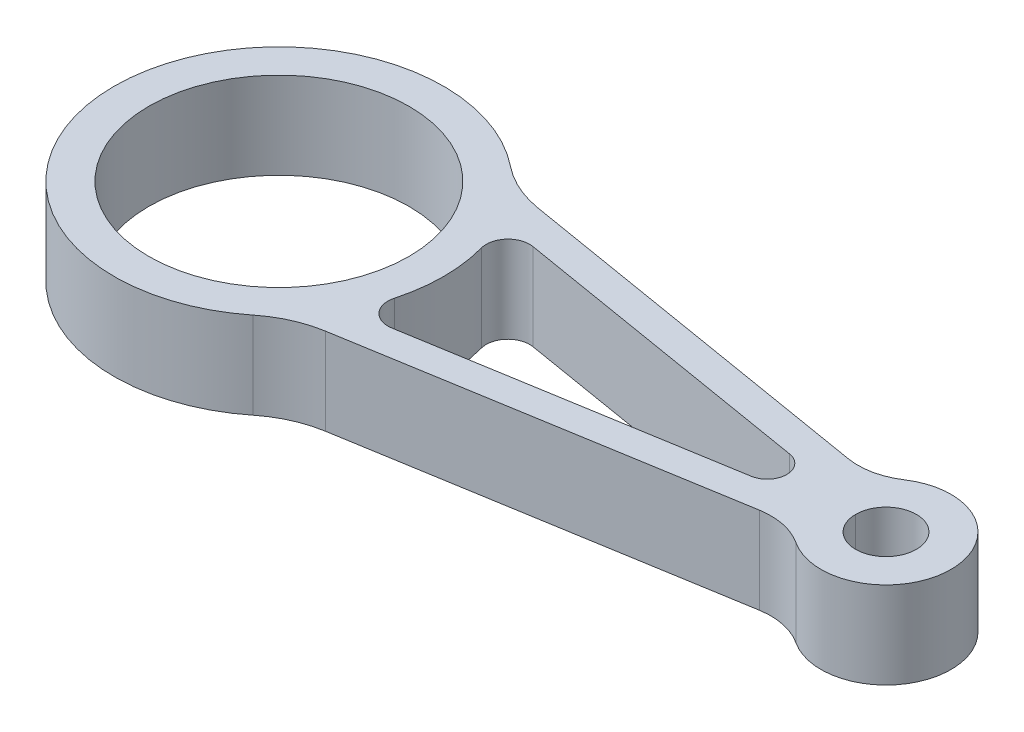
ISO-10303-21;
HEADER;
FILE_DESCRIPTION(('STEP AP214'),'2;1');
FILE_NAME('part.step','',(''),(''),'','','');
FILE_SCHEMA(('AUTOMOTIVE_DESIGN { 1 0 10303 214 1 1 1 1 }'));
ENDSEC;
DATA;
#1=APPLICATION_CONTEXT('core data for automotive mechanical design processes');
#2=APPLICATION_PROTOCOL_DEFINITION('international standard','automotive_design',2000,#1);
#3=PRODUCT_CONTEXT('',#1,'mechanical');
#4=PRODUCT('Part','Part','',(#3));
#5=PRODUCT_RELATED_PRODUCT_CATEGORY('part','',(#4));
#6=PRODUCT_DEFINITION_FORMATION('','',#4);
#7=PRODUCT_DEFINITION_CONTEXT('part definition',#1,'design');
#8=PRODUCT_DEFINITION('design','',#6,#7);
#9=PRODUCT_DEFINITION_SHAPE('','',#8);
#10=(LENGTH_UNIT() NAMED_UNIT(*) SI_UNIT(.MILLI.,.METRE.));
#11=(NAMED_UNIT(*) PLANE_ANGLE_UNIT() SI_UNIT($,.RADIAN.));
#12=(NAMED_UNIT(*) SI_UNIT($,.STERADIAN.) SOLID_ANGLE_UNIT());
#13=UNCERTAINTY_MEASURE_WITH_UNIT(LENGTH_MEASURE(1.E-05),#10,'distance_accuracy_value','');
#14=(GEOMETRIC_REPRESENTATION_CONTEXT(3) GLOBAL_UNCERTAINTY_ASSIGNED_CONTEXT((#13)) GLOBAL_UNIT_ASSIGNED_CONTEXT((#10,
#11,#12)) REPRESENTATION_CONTEXT('',''));
#15=CARTESIAN_POINT('',(0.,0.,0.));
#16=DIRECTION('',(0.,0.,1.));
#17=DIRECTION('',(1.,0.,0.));
#18=AXIS2_PLACEMENT_3D('',#15,#16,#17);
#19=CARTESIAN_POINT('',(140.,10.,0.));
#20=DIRECTION('',(0.,-1.,0.));
#21=DIRECTION('',(0.,0.,-1.));
#22=AXIS2_PLACEMENT_3D('',#19,#20,#21);
#23=CYLINDRICAL_SURFACE('',#22,7.00000000000001);
#24=CARTESIAN_POINT('',(140.,10.,0.));
#25=DIRECTION('',(0.,1.,0.));
#26=DIRECTION('',(0.,0.,1.));
#27=AXIS2_PLACEMENT_3D('',#24,#25,#26);
#28=CIRCLE('',#27,7.00000000000001);
#29=CARTESIAN_POINT('',(147.,10.,0.));
#30=VERTEX_POINT('',#29);
#31=CARTESIAN_POINT('',(133.,10.,0.));
#32=VERTEX_POINT('',#31);
#33=EDGE_CURVE('E232',#30,#32,#28,.T.);
#34=ORIENTED_EDGE('',*,*,#33,.T.);
#35=DIRECTION('',(0.,-1.,0.));
#36=VECTOR('',#35,1.);
#37=CARTESIAN_POINT('',(133.,10.,0.));
#38=LINE('',#37,#36);
#39=CARTESIAN_POINT('',(133.,-10.,0.));
#40=VERTEX_POINT('',#39);
#41=EDGE_CURVE('E11',#32,#40,#38,.T.);
#42=ORIENTED_EDGE('',*,*,#41,.T.);
#43=CARTESIAN_POINT('',(140.,-10.,0.));
#44=DIRECTION('',(0.,1.,0.));
#45=DIRECTION('',(0.,0.,1.));
#46=AXIS2_PLACEMENT_3D('',#43,#44,#45);
#47=CIRCLE('',#46,7.00000000000001);
#48=CARTESIAN_POINT('',(147.,-10.,0.));
#49=VERTEX_POINT('',#48);
#50=EDGE_CURVE('E237',#49,#40,#47,.T.);
#51=ORIENTED_EDGE('',*,*,#50,.F.);
#52=DIRECTION('',(0.,1.,0.));
#53=VECTOR('',#52,1.);
#54=CARTESIAN_POINT('',(147.,10.,0.));
#55=LINE('',#54,#53);
#56=EDGE_CURVE('E52',#49,#30,#55,.T.);
#57=ORIENTED_EDGE('',*,*,#56,.T.);
#58=EDGE_LOOP('',(#34,#42,#51,#57));
#59=FACE_BOUND('',#58,.T.);
#60=ADVANCED_FACE('F43',(#59),#23,.F.);
#61=CARTESIAN_POINT('',(0.,10.,0.));
#62=DIRECTION('',(0.,1.,0.));
#63=DIRECTION('',(0.,0.,1.));
#64=AXIS2_PLACEMENT_3D('',#61,#62,#63);
#65=PLANE('',#64);
#66=CARTESIAN_POINT('',(112.608695652174,10.,0.));
#67=DIRECTION('',(0.,-1.,0.));
#68=DIRECTION('',(0.,0.,1.));
#69=AXIS2_PLACEMENT_3D('',#66,#67,#68);
#70=CIRCLE('',#69,4.5);
#71=CARTESIAN_POINT('',(113.34798136646,10.,-4.4388575819295));
#72=VERTEX_POINT('',#71);
#73=CARTESIAN_POINT('',(113.34798136646,10.,4.43885758192951));
#74=VERTEX_POINT('',#73);
#75=EDGE_CURVE('E158',#72,#74,#70,.T.);
#76=ORIENTED_EDGE('',*,*,#75,.T.);
#77=DIRECTION('',(-0.986412795984335,0.,0.164285714285714));
#78=VECTOR('',#77,1.);
#79=CARTESIAN_POINT('',(42.2992225293056,10.,16.2719320738592));
#80=LINE('',#79,#78);
#81=CARTESIAN_POINT('',(42.2992225293056,10.,16.2719320738592));
#82=VERTEX_POINT('',#81);
#83=EDGE_CURVE('E171',#74,#82,#80,.T.);
#84=ORIENTED_EDGE('',*,*,#83,.T.);
#85=CARTESIAN_POINT('',(41.477793957877,10.,11.3398680939376));
#86=DIRECTION('',(0.,-1.,0.));
#87=DIRECTION('',(0.,0.,1.));
#88=AXIS2_PLACEMENT_3D('',#85,#86,#87);
#89=CIRCLE('',#88,5.);
#90=CARTESIAN_POINT('',(36.6547946604494,10.,10.021278780689));
#91=VERTEX_POINT('',#90);
#92=EDGE_CURVE('E176',#82,#91,#89,.T.);
#93=ORIENTED_EDGE('',*,*,#92,.T.);
#94=CARTESIAN_POINT('',(0.,10.,0.));
#95=DIRECTION('',(0.,1.,0.));
#96=DIRECTION('',(0.,0.,1.));
#97=AXIS2_PLACEMENT_3D('',#94,#95,#96);
#98=CIRCLE('',#97,38.);
#99=CARTESIAN_POINT('',(36.6547946604494,10.,-10.021278780689));
#100=VERTEX_POINT('',#99);
#101=EDGE_CURVE('E192',#91,#100,#98,.T.);
#102=ORIENTED_EDGE('',*,*,#101,.T.);
#103=CARTESIAN_POINT('',(41.477793957877,10.,-11.3398680939376));
#104=DIRECTION('',(0.,-1.,0.));
#105=DIRECTION('',(0.,0.,-1.));
#106=AXIS2_PLACEMENT_3D('',#103,#104,#105);
#107=CIRCLE('',#106,5.);
#108=CARTESIAN_POINT('',(42.2992225293056,10.,-16.2719320738592));
#109=VERTEX_POINT('',#108);
#110=EDGE_CURVE('E196',#100,#109,#107,.T.);
#111=ORIENTED_EDGE('',*,*,#110,.T.);
#112=DIRECTION('',(0.986412795984335,0.,0.164285714285714));
#113=VECTOR('',#112,1.);
#114=CARTESIAN_POINT('',(42.2992225293056,10.,-16.2719320738592));
#115=LINE('',#114,#113);
#116=EDGE_CURVE('E167',#109,#72,#115,.T.);
#117=ORIENTED_EDGE('',*,*,#116,.T.);
#118=EDGE_LOOP('',(#76,#84,#93,#102,#111,#117));
#119=FACE_BOUND('',#118,.T.);
#120=CARTESIAN_POINT('',(0.,10.,0.));
#121=DIRECTION('',(0.,1.,0.));
#122=DIRECTION('',(0.,0.,1.));
#123=AXIS2_PLACEMENT_3D('',#120,#121,#122);
#124=CIRCLE('',#123,30.);
#125=CARTESIAN_POINT('',(0.,10.,30.));
#126=VERTEX_POINT('',#125);
#127=EDGE_CURVE('E241',#126,#126,#124,.T.);
#128=ORIENTED_EDGE('',*,*,#127,.F.);
#129=EDGE_LOOP('',(#128));
#130=FACE_BOUND('',#129,.T.);
#131=DIRECTION('',(-0.986412795984335,0.,-0.164285714285714));
#132=VECTOR('',#131,1.);
#133=CARTESIAN_POINT('',(27.9354736759495,10.,-25.7606154914888));
#134=LINE('',#133,#132);
#135=CARTESIAN_POINT('',(121.031047619273,10.,-10.2556738236799));
#136=VERTEX_POINT('',#135);
#137=CARTESIAN_POINT('',(35.2356932426445,10.,-24.544773816645));
#138=VERTEX_POINT('',#137);
#139=EDGE_CURVE('E261',#136,#138,#134,.T.);
#140=ORIENTED_EDGE('',*,*,#139,.T.);
#141=CARTESIAN_POINT('',(39.3428360997873,10.,-49.2050937162533));
#142=DIRECTION('',(0.,1.,0.));
#143=DIRECTION('',(0.,0.,1.));
#144=AXIS2_PLACEMENT_3D('',#141,#142,#143);
#145=CIRCLE('',#144,25.);
#146=CARTESIAN_POINT('',(23.7305995522527,10.,-29.6792628764703));
#147=VERTEX_POINT('',#146);
#148=EDGE_CURVE('E329',#138,#147,#145,.F.);
#149=ORIENTED_EDGE('',*,*,#148,.T.);
#150=CARTESIAN_POINT('',(0.,10.,0.));
#151=DIRECTION('',(0.,1.,0.));
#152=DIRECTION('',(0.,0.,1.));
#153=AXIS2_PLACEMENT_3D('',#150,#151,#152);
#154=CIRCLE('',#153,38.);
#155=CARTESIAN_POINT('',(23.7305995522527,10.,29.6792628764703));
#156=VERTEX_POINT('',#155);
#157=EDGE_CURVE('E249',#147,#156,#154,.T.);
#158=ORIENTED_EDGE('',*,*,#157,.T.);
#159=CARTESIAN_POINT('',(39.3428360997873,10.,49.2050937162533));
#160=DIRECTION('',(0.,1.,0.));
#161=DIRECTION('',(0.,0.,1.));
#162=AXIS2_PLACEMENT_3D('',#159,#160,#161);
#163=CIRCLE('',#162,25.);
#164=CARTESIAN_POINT('',(35.2356932426445,10.,24.544773816645));
#165=VERTEX_POINT('',#164);
#166=EDGE_CURVE('E323',#156,#165,#163,.F.);
#167=ORIENTED_EDGE('',*,*,#166,.T.);
#168=DIRECTION('',(0.986412795984335,0.,-0.164285714285714));
#169=VECTOR('',#168,1.);
#170=CARTESIAN_POINT('',(27.9354736759495,10.,25.7606154914888));
#171=LINE('',#170,#169);
#172=CARTESIAN_POINT('',(121.031047619273,10.,10.2556738236799));
#173=VERTEX_POINT('',#172);
#174=EDGE_CURVE('E253',#165,#173,#171,.T.);
#175=ORIENTED_EDGE('',*,*,#174,.T.);
#176=CARTESIAN_POINT('',(123.495333333559,10.,25.0518657634449));
#177=DIRECTION('',(0.,1.,0.));
#178=DIRECTION('',(0.,0.,1.));
#179=AXIS2_PLACEMENT_3D('',#176,#177,#178);
#180=CIRCLE('',#179,15.);
#181=CARTESIAN_POINT('',(131.747666666779,10.,12.5259328817225));
#182=VERTEX_POINT('',#181);
#183=EDGE_CURVE('E303',#173,#182,#180,.F.);
#184=ORIENTED_EDGE('',*,*,#183,.T.);
#185=CARTESIAN_POINT('',(140.,10.,0.));
#186=DIRECTION('',(0.,1.,0.));
#187=DIRECTION('',(0.,0.,-1.));
#188=AXIS2_PLACEMENT_3D('',#185,#186,#187);
#189=CIRCLE('',#188,15.);
#190=CARTESIAN_POINT('',(131.747666666779,10.,-12.5259328817225));
#191=VERTEX_POINT('',#190);
#192=EDGE_CURVE('E257',#182,#191,#189,.T.);
#193=ORIENTED_EDGE('',*,*,#192,.T.);
#194=CARTESIAN_POINT('',(123.495333333559,10.,-25.0518657634449));
#195=DIRECTION('',(0.,1.,0.));
#196=DIRECTION('',(0.,0.,1.));
#197=AXIS2_PLACEMENT_3D('',#194,#195,#196);
#198=CIRCLE('',#197,15.);
#199=EDGE_CURVE('E296',#191,#136,#198,.F.);
#200=ORIENTED_EDGE('',*,*,#199,.T.);
#201=EDGE_LOOP('',(#140,#149,#158,#167,#175,#184,#193,#200));
#202=FACE_BOUND('',#201,.T.);
#203=ORIENTED_EDGE('',*,*,#33,.F.);
#204=EDGE_CURVE('E236',#32,#30,#28,.T.);
#205=ORIENTED_EDGE('',*,*,#204,.F.);
#206=EDGE_LOOP('',(#203,#205));
#207=FACE_BOUND('',#206,.T.);
#208=ADVANCED_FACE('F178',(#119,#130,#202,#207),#65,.T.);
#209=CARTESIAN_POINT('',(0.,-10.,0.));
#210=DIRECTION('',(0.,1.,0.));
#211=DIRECTION('',(0.,0.,1.));
#212=AXIS2_PLACEMENT_3D('',#209,#210,#211);
#213=PLANE('',#212);
#214=DIRECTION('',(-0.986412795984335,0.,0.164285714285714));
#215=VECTOR('',#214,1.);
#216=CARTESIAN_POINT('',(42.2992225293056,-10.,16.2719320738592));
#217=LINE('',#216,#215);
#218=CARTESIAN_POINT('',(113.34798136646,-10.,4.43885758192951));
#219=VERTEX_POINT('',#218);
#220=CARTESIAN_POINT('',(42.2992225293056,-10.,16.2719320738592));
#221=VERTEX_POINT('',#220);
#222=EDGE_CURVE('E203',#219,#221,#217,.T.);
#223=ORIENTED_EDGE('',*,*,#222,.F.);
#224=CARTESIAN_POINT('',(112.608695652174,-10.,0.));
#225=DIRECTION('',(0.,-1.,0.));
#226=DIRECTION('',(0.,0.,1.));
#227=AXIS2_PLACEMENT_3D('',#224,#225,#226);
#228=CIRCLE('',#227,4.5);
#229=CARTESIAN_POINT('',(113.34798136646,-10.,-4.4388575819295));
#230=VERTEX_POINT('',#229);
#231=EDGE_CURVE('E161',#230,#219,#228,.T.);
#232=ORIENTED_EDGE('',*,*,#231,.F.);
#233=DIRECTION('',(0.986412795984335,0.,0.164285714285714));
#234=VECTOR('',#233,1.);
#235=CARTESIAN_POINT('',(42.2992225293056,-10.,-16.2719320738592));
#236=LINE('',#235,#234);
#237=CARTESIAN_POINT('',(42.2992225293056,-10.,-16.2719320738592));
#238=VERTEX_POINT('',#237);
#239=EDGE_CURVE('E183',#238,#230,#236,.T.);
#240=ORIENTED_EDGE('',*,*,#239,.F.);
#241=CARTESIAN_POINT('',(41.477793957877,-10.,-11.3398680939376));
#242=DIRECTION('',(0.,-1.,0.));
#243=DIRECTION('',(0.,0.,-1.));
#244=AXIS2_PLACEMENT_3D('',#241,#242,#243);
#245=CIRCLE('',#244,5.);
#246=CARTESIAN_POINT('',(36.6547946604494,-10.,-10.021278780689));
#247=VERTEX_POINT('',#246);
#248=EDGE_CURVE('E187',#247,#238,#245,.T.);
#249=ORIENTED_EDGE('',*,*,#248,.F.);
#250=CARTESIAN_POINT('',(0.,-10.,0.));
#251=DIRECTION('',(0.,1.,0.));
#252=DIRECTION('',(0.,0.,1.));
#253=AXIS2_PLACEMENT_3D('',#250,#251,#252);
#254=CIRCLE('',#253,38.);
#255=CARTESIAN_POINT('',(36.6547946604494,-10.,10.021278780689));
#256=VERTEX_POINT('',#255);
#257=EDGE_CURVE('E210',#256,#247,#254,.T.);
#258=ORIENTED_EDGE('',*,*,#257,.F.);
#259=CARTESIAN_POINT('',(41.477793957877,-10.,11.3398680939376));
#260=DIRECTION('',(0.,-1.,0.));
#261=DIRECTION('',(0.,0.,1.));
#262=AXIS2_PLACEMENT_3D('',#259,#260,#261);
#263=CIRCLE('',#262,5.);
#264=EDGE_CURVE('E206',#221,#256,#263,.T.);
#265=ORIENTED_EDGE('',*,*,#264,.F.);
#266=EDGE_LOOP('',(#223,#232,#240,#249,#258,#265));
#267=FACE_BOUND('',#266,.T.);
#268=CARTESIAN_POINT('',(0.,-10.,0.));
#269=DIRECTION('',(0.,1.,0.));
#270=DIRECTION('',(0.,0.,1.));
#271=AXIS2_PLACEMENT_3D('',#268,#269,#270);
#272=CIRCLE('',#271,38.);
#273=CARTESIAN_POINT('',(23.7305995522527,-10.,-29.6792628764703));
#274=VERTEX_POINT('',#273);
#275=CARTESIAN_POINT('',(23.7305995522527,-10.,29.6792628764703));
#276=VERTEX_POINT('',#275);
#277=EDGE_CURVE('E245',#274,#276,#272,.T.);
#278=ORIENTED_EDGE('',*,*,#277,.F.);
#279=CARTESIAN_POINT('',(39.3428360997873,-10.,-49.2050937162533));
#280=DIRECTION('',(0.,1.,0.));
#281=DIRECTION('',(0.,0.,1.));
#282=AXIS2_PLACEMENT_3D('',#279,#280,#281);
#283=CIRCLE('',#282,25.);
#284=CARTESIAN_POINT('',(35.2356932426445,-10.,-24.544773816645));
#285=VERTEX_POINT('',#284);
#286=EDGE_CURVE('E326',#274,#285,#283,.T.);
#287=ORIENTED_EDGE('',*,*,#286,.T.);
#288=DIRECTION('',(-0.986412795984335,0.,-0.164285714285714));
#289=VECTOR('',#288,1.);
#290=CARTESIAN_POINT('',(27.9354736759495,-10.,-25.7606154914888));
#291=LINE('',#290,#289);
#292=CARTESIAN_POINT('',(121.031047619273,-10.,-10.2556738236799));
#293=VERTEX_POINT('',#292);
#294=EDGE_CURVE('E254',#293,#285,#291,.T.);
#295=ORIENTED_EDGE('',*,*,#294,.F.);
#296=CARTESIAN_POINT('',(123.495333333559,-10.,-25.0518657634449));
#297=DIRECTION('',(0.,1.,0.));
#298=DIRECTION('',(0.,0.,1.));
#299=AXIS2_PLACEMENT_3D('',#296,#297,#298);
#300=CIRCLE('',#299,15.);
#301=CARTESIAN_POINT('',(131.747666666779,-10.,-12.5259328817225));
#302=VERTEX_POINT('',#301);
#303=EDGE_CURVE('E293',#293,#302,#300,.T.);
#304=ORIENTED_EDGE('',*,*,#303,.T.);
#305=CARTESIAN_POINT('',(140.,-10.,0.));
#306=DIRECTION('',(0.,1.,0.));
#307=DIRECTION('',(0.,0.,-1.));
#308=AXIS2_PLACEMENT_3D('',#305,#306,#307);
#309=CIRCLE('',#308,15.);
#310=CARTESIAN_POINT('',(131.747666666779,-10.,12.5259328817225));
#311=VERTEX_POINT('',#310);
#312=EDGE_CURVE('E272',#311,#302,#309,.T.);
#313=ORIENTED_EDGE('',*,*,#312,.F.);
#314=CARTESIAN_POINT('',(123.495333333559,-10.,25.0518657634449));
#315=DIRECTION('',(0.,1.,0.));
#316=DIRECTION('',(0.,0.,1.));
#317=AXIS2_PLACEMENT_3D('',#314,#315,#316);
#318=CIRCLE('',#317,15.);
#319=CARTESIAN_POINT('',(121.031047619273,-10.,10.2556738236799));
#320=VERTEX_POINT('',#319);
#321=EDGE_CURVE('E299',#311,#320,#318,.T.);
#322=ORIENTED_EDGE('',*,*,#321,.T.);
#323=DIRECTION('',(0.986412795984335,0.,-0.164285714285714));
#324=VECTOR('',#323,1.);
#325=CARTESIAN_POINT('',(27.9354736759495,-10.,25.7606154914888));
#326=LINE('',#325,#324);
#327=CARTESIAN_POINT('',(35.2356932426445,-10.,24.544773816645));
#328=VERTEX_POINT('',#327);
#329=EDGE_CURVE('E269',#328,#320,#326,.T.);
#330=ORIENTED_EDGE('',*,*,#329,.F.);
#331=CARTESIAN_POINT('',(39.3428360997873,-10.,49.2050937162533));
#332=DIRECTION('',(0.,1.,0.));
#333=DIRECTION('',(0.,0.,1.));
#334=AXIS2_PLACEMENT_3D('',#331,#332,#333);
#335=CIRCLE('',#334,25.);
#336=EDGE_CURVE('E320',#328,#276,#335,.T.);
#337=ORIENTED_EDGE('',*,*,#336,.T.);
#338=EDGE_LOOP('',(#278,#287,#295,#304,#313,#322,#330,#337));
#339=FACE_BOUND('',#338,.T.);
#340=CARTESIAN_POINT('',(0.,-10.,0.));
#341=DIRECTION('',(0.,1.,0.));
#342=DIRECTION('',(0.,0.,1.));
#343=AXIS2_PLACEMENT_3D('',#340,#341,#342);
#344=CIRCLE('',#343,30.);
#345=CARTESIAN_POINT('',(0.,-10.,30.));
#346=VERTEX_POINT('',#345);
#347=EDGE_CURVE('E235',#346,#346,#344,.T.);
#348=ORIENTED_EDGE('',*,*,#347,.T.);
#349=EDGE_LOOP('',(#348));
#350=FACE_BOUND('',#349,.T.);
#351=ORIENTED_EDGE('',*,*,#50,.T.);
#352=EDGE_CURVE('E220',#40,#49,#47,.T.);
#353=ORIENTED_EDGE('',*,*,#352,.T.);
#354=EDGE_LOOP('',(#351,#353));
#355=FACE_BOUND('',#354,.T.);
#356=ADVANCED_FACE('F340',(#267,#339,#350,#355),#213,.F.);
#357=CARTESIAN_POINT('',(0.,10.,0.));
#358=DIRECTION('',(0.,-1.,0.));
#359=DIRECTION('',(0.,0.,-1.));
#360=AXIS2_PLACEMENT_3D('',#357,#358,#359);
#361=CYLINDRICAL_SURFACE('',#360,38.);
#362=ORIENTED_EDGE('',*,*,#277,.T.);
#363=DIRECTION('',(0.,-1.,0.));
#364=VECTOR('',#363,1.);
#365=CARTESIAN_POINT('',(23.7305995522527,10.,29.6792628764703));
#366=LINE('',#365,#364);
#367=EDGE_CURVE('E314',#276,#156,#366,.F.);
#368=ORIENTED_EDGE('',*,*,#367,.T.);
#369=ORIENTED_EDGE('',*,*,#157,.F.);
#370=DIRECTION('',(0.,-1.,0.));
#371=VECTOR('',#370,1.);
#372=CARTESIAN_POINT('',(23.7305995522527,10.,-29.6792628764703));
#373=LINE('',#372,#371);
#374=EDGE_CURVE('E310',#147,#274,#373,.T.);
#375=ORIENTED_EDGE('',*,*,#374,.T.);
#376=EDGE_LOOP('',(#362,#368,#369,#375));
#377=FACE_BOUND('',#376,.T.);
#378=ADVANCED_FACE('F365',(#377),#361,.T.);
#379=CARTESIAN_POINT('',(27.9354736759495,10.,25.7606154914888));
#380=DIRECTION('',(-0.164285714285714,0.,-0.986412795984335));
#381=DIRECTION('',(-0.986412795984335,0.,0.164285714285714));
#382=AXIS2_PLACEMENT_3D('',#379,#380,#381);
#383=PLANE('',#382);
#384=ORIENTED_EDGE('',*,*,#174,.F.);
#385=DIRECTION('',(0.,1.,0.));
#386=VECTOR('',#385,1.);
#387=CARTESIAN_POINT('',(35.2356932426445,-10.,24.544773816645));
#388=LINE('',#387,#386);
#389=EDGE_CURVE('E306',#165,#328,#388,.F.);
#390=ORIENTED_EDGE('',*,*,#389,.T.);
#391=ORIENTED_EDGE('',*,*,#329,.T.);
#392=DIRECTION('',(0.,1.,0.));
#393=VECTOR('',#392,1.);
#394=CARTESIAN_POINT('',(121.031047619273,10.,10.2556738236799));
#395=LINE('',#394,#393);
#396=EDGE_CURVE('E289',#320,#173,#395,.T.);
#397=ORIENTED_EDGE('',*,*,#396,.T.);
#398=EDGE_LOOP('',(#384,#390,#391,#397));
#399=FACE_BOUND('',#398,.T.);
#400=ADVANCED_FACE('F375',(#399),#383,.F.);
#401=CARTESIAN_POINT('',(140.,10.,0.));
#402=DIRECTION('',(0.,-1.,0.));
#403=DIRECTION('',(0.,0.,-1.));
#404=AXIS2_PLACEMENT_3D('',#401,#402,#403);
#405=CYLINDRICAL_SURFACE('',#404,15.);
#406=ORIENTED_EDGE('',*,*,#312,.T.);
#407=DIRECTION('',(0.,-1.,0.));
#408=VECTOR('',#407,1.);
#409=CARTESIAN_POINT('',(131.747666666779,10.,-12.5259328817225));
#410=LINE('',#409,#408);
#411=EDGE_CURVE('E286',#302,#191,#410,.F.);
#412=ORIENTED_EDGE('',*,*,#411,.T.);
#413=ORIENTED_EDGE('',*,*,#192,.F.);
#414=DIRECTION('',(0.,-1.,0.));
#415=VECTOR('',#414,1.);
#416=CARTESIAN_POINT('',(131.747666666779,10.,12.5259328817225));
#417=LINE('',#416,#415);
#418=EDGE_CURVE('E282',#182,#311,#417,.T.);
#419=ORIENTED_EDGE('',*,*,#418,.T.);
#420=EDGE_LOOP('',(#406,#412,#413,#419));
#421=FACE_BOUND('',#420,.T.);
#422=ADVANCED_FACE('F371',(#421),#405,.T.);
#423=CARTESIAN_POINT('',(27.9354736759495,10.,-25.7606154914888));
#424=DIRECTION('',(-0.164285714285714,0.,0.986412795984335));
#425=DIRECTION('',(0.986412795984335,0.,0.164285714285714));
#426=AXIS2_PLACEMENT_3D('',#423,#424,#425);
#427=PLANE('',#426);
#428=ORIENTED_EDGE('',*,*,#294,.T.);
#429=DIRECTION('',(0.,1.,0.));
#430=VECTOR('',#429,1.);
#431=CARTESIAN_POINT('',(35.2356932426445,10.,-24.544773816645));
#432=LINE('',#431,#430);
#433=EDGE_CURVE('E317',#285,#138,#432,.T.);
#434=ORIENTED_EDGE('',*,*,#433,.T.);
#435=ORIENTED_EDGE('',*,*,#139,.F.);
#436=DIRECTION('',(0.,1.,0.));
#437=VECTOR('',#436,1.);
#438=CARTESIAN_POINT('',(121.031047619273,-10.,-10.2556738236799));
#439=LINE('',#438,#437);
#440=EDGE_CURVE('E265',#136,#293,#439,.F.);
#441=ORIENTED_EDGE('',*,*,#440,.T.);
#442=EDGE_LOOP('',(#428,#434,#435,#441));
#443=FACE_BOUND('',#442,.T.);
#444=ADVANCED_FACE('F353',(#443),#427,.F.);
#445=CARTESIAN_POINT('',(0.,10.,0.));
#446=DIRECTION('',(0.,-1.,0.));
#447=DIRECTION('',(0.,0.,-1.));
#448=AXIS2_PLACEMENT_3D('',#445,#446,#447);
#449=CYLINDRICAL_SURFACE('',#448,30.);
#450=ORIENTED_EDGE('',*,*,#127,.T.);
#451=EDGE_LOOP('',(#450));
#452=FACE_BOUND('',#451,.T.);
#453=ORIENTED_EDGE('',*,*,#347,.F.);
#454=EDGE_LOOP('',(#453));
#455=FACE_BOUND('',#454,.T.);
#456=ADVANCED_FACE('F344',(#452,#455),#449,.F.);
#457=ORIENTED_EDGE('',*,*,#41,.F.);
#458=ORIENTED_EDGE('',*,*,#204,.T.);
#459=ORIENTED_EDGE('',*,*,#56,.F.);
#460=ORIENTED_EDGE('',*,*,#352,.F.);
#461=EDGE_LOOP('',(#457,#458,#459,#460));
#462=FACE_BOUND('',#461,.T.);
#463=ADVANCED_FACE('F341',(#462),#23,.F.);
#464=CARTESIAN_POINT('',(123.495333333559,10.,-25.0518657634449));
#465=DIRECTION('',(0.,-1.,0.));
#466=DIRECTION('',(0.,0.,-1.));
#467=AXIS2_PLACEMENT_3D('',#464,#465,#466);
#468=CYLINDRICAL_SURFACE('',#467,15.);
#469=ORIENTED_EDGE('',*,*,#199,.F.);
#470=ORIENTED_EDGE('',*,*,#411,.F.);
#471=ORIENTED_EDGE('',*,*,#303,.F.);
#472=ORIENTED_EDGE('',*,*,#440,.F.);
#473=EDGE_LOOP('',(#469,#470,#471,#472));
#474=FACE_BOUND('',#473,.T.);
#475=ADVANCED_FACE('F343',(#474),#468,.F.);
#476=CARTESIAN_POINT('',(123.495333333559,10.,25.0518657634449));
#477=DIRECTION('',(0.,-1.,0.));
#478=DIRECTION('',(0.,0.,-1.));
#479=AXIS2_PLACEMENT_3D('',#476,#477,#478);
#480=CYLINDRICAL_SURFACE('',#479,15.);
#481=ORIENTED_EDGE('',*,*,#183,.F.);
#482=ORIENTED_EDGE('',*,*,#396,.F.);
#483=ORIENTED_EDGE('',*,*,#321,.F.);
#484=ORIENTED_EDGE('',*,*,#418,.F.);
#485=EDGE_LOOP('',(#481,#482,#483,#484));
#486=FACE_BOUND('',#485,.T.);
#487=ADVANCED_FACE('F350',(#486),#480,.F.);
#488=CARTESIAN_POINT('',(39.3428360997873,10.,49.2050937162533));
#489=DIRECTION('',(0.,-1.,0.));
#490=DIRECTION('',(0.,0.,-1.));
#491=AXIS2_PLACEMENT_3D('',#488,#489,#490);
#492=CYLINDRICAL_SURFACE('',#491,25.);
#493=ORIENTED_EDGE('',*,*,#166,.F.);
#494=ORIENTED_EDGE('',*,*,#367,.F.);
#495=ORIENTED_EDGE('',*,*,#336,.F.);
#496=ORIENTED_EDGE('',*,*,#389,.F.);
#497=EDGE_LOOP('',(#493,#494,#495,#496));
#498=FACE_BOUND('',#497,.T.);
#499=ADVANCED_FACE('F384',(#498),#492,.F.);
#500=CARTESIAN_POINT('',(39.3428360997873,10.,-49.2050937162533));
#501=DIRECTION('',(0.,-1.,0.));
#502=DIRECTION('',(0.,0.,-1.));
#503=AXIS2_PLACEMENT_3D('',#500,#501,#502);
#504=CYLINDRICAL_SURFACE('',#503,25.);
#505=ORIENTED_EDGE('',*,*,#148,.F.);
#506=ORIENTED_EDGE('',*,*,#433,.F.);
#507=ORIENTED_EDGE('',*,*,#286,.F.);
#508=ORIENTED_EDGE('',*,*,#374,.F.);
#509=EDGE_LOOP('',(#505,#506,#507,#508));
#510=FACE_BOUND('',#509,.T.);
#511=ADVANCED_FACE('F45',(#510),#504,.F.);
#512=CARTESIAN_POINT('',(112.608695652174,10.,0.));
#513=DIRECTION('',(0.,-1.,0.));
#514=DIRECTION('',(0.,0.,-1.));
#515=AXIS2_PLACEMENT_3D('',#512,#513,#514);
#516=CYLINDRICAL_SURFACE('',#515,4.5);
#517=ORIENTED_EDGE('',*,*,#231,.T.);
#518=DIRECTION('',(0.,-1.,0.));
#519=VECTOR('',#518,1.);
#520=CARTESIAN_POINT('',(113.34798136646,10.,4.43885758192951));
#521=LINE('',#520,#519);
#522=EDGE_CURVE('E154',#74,#219,#521,.T.);
#523=ORIENTED_EDGE('',*,*,#522,.F.);
#524=ORIENTED_EDGE('',*,*,#75,.F.);
#525=DIRECTION('',(0.,-1.,0.));
#526=VECTOR('',#525,1.);
#527=CARTESIAN_POINT('',(113.34798136646,10.,-4.4388575819295));
#528=LINE('',#527,#526);
#529=EDGE_CURVE('E217',#72,#230,#528,.T.);
#530=ORIENTED_EDGE('',*,*,#529,.T.);
#531=EDGE_LOOP('',(#517,#523,#524,#530));
#532=FACE_BOUND('',#531,.T.);
#533=ADVANCED_FACE('F156',(#532),#516,.F.);
#534=CARTESIAN_POINT('',(42.2992225293056,10.,-16.2719320738592));
#535=DIRECTION('',(0.164285714285714,0.,-0.986412795984335));
#536=DIRECTION('',(-0.986412795984335,0.,-0.164285714285714));
#537=AXIS2_PLACEMENT_3D('',#534,#535,#536);
#538=PLANE('',#537);
#539=ORIENTED_EDGE('',*,*,#239,.T.);
#540=ORIENTED_EDGE('',*,*,#529,.F.);
#541=ORIENTED_EDGE('',*,*,#116,.F.);
#542=DIRECTION('',(0.,-1.,0.));
#543=VECTOR('',#542,1.);
#544=CARTESIAN_POINT('',(42.2992225293056,10.,-16.2719320738592));
#545=LINE('',#544,#543);
#546=EDGE_CURVE('E221',#109,#238,#545,.T.);
#547=ORIENTED_EDGE('',*,*,#546,.T.);
#548=EDGE_LOOP('',(#539,#540,#541,#547));
#549=FACE_BOUND('',#548,.T.);
#550=ADVANCED_FACE('F420',(#549),#538,.F.);
#551=CARTESIAN_POINT('',(41.477793957877,10.,-11.3398680939376));
#552=DIRECTION('',(0.,-1.,0.));
#553=DIRECTION('',(0.,0.,-1.));
#554=AXIS2_PLACEMENT_3D('',#551,#552,#553);
#555=CYLINDRICAL_SURFACE('',#554,5.);
#556=ORIENTED_EDGE('',*,*,#248,.T.);
#557=ORIENTED_EDGE('',*,*,#546,.F.);
#558=ORIENTED_EDGE('',*,*,#110,.F.);
#559=DIRECTION('',(0.,-1.,0.));
#560=VECTOR('',#559,1.);
#561=CARTESIAN_POINT('',(36.6547946604494,10.,-10.021278780689));
#562=LINE('',#561,#560);
#563=EDGE_CURVE('E224',#100,#247,#562,.T.);
#564=ORIENTED_EDGE('',*,*,#563,.T.);
#565=EDGE_LOOP('',(#556,#557,#558,#564));
#566=FACE_BOUND('',#565,.T.);
#567=ADVANCED_FACE('F424',(#566),#555,.F.);
#568=CARTESIAN_POINT('',(0.,10.,0.));
#569=DIRECTION('',(0.,-1.,0.));
#570=DIRECTION('',(0.,0.,-1.));
#571=AXIS2_PLACEMENT_3D('',#568,#569,#570);
#572=CYLINDRICAL_SURFACE('',#571,38.);
#573=ORIENTED_EDGE('',*,*,#257,.T.);
#574=ORIENTED_EDGE('',*,*,#563,.F.);
#575=ORIENTED_EDGE('',*,*,#101,.F.);
#576=DIRECTION('',(0.,-1.,0.));
#577=VECTOR('',#576,1.);
#578=CARTESIAN_POINT('',(36.6547946604494,10.,10.021278780689));
#579=LINE('',#578,#577);
#580=EDGE_CURVE('E227',#91,#256,#579,.T.);
#581=ORIENTED_EDGE('',*,*,#580,.T.);
#582=EDGE_LOOP('',(#573,#574,#575,#581));
#583=FACE_BOUND('',#582,.T.);
#584=ADVANCED_FACE('F433',(#583),#572,.T.);
#585=CARTESIAN_POINT('',(41.477793957877,10.,11.3398680939376));
#586=DIRECTION('',(0.,-1.,0.));
#587=DIRECTION('',(0.,0.,-1.));
#588=AXIS2_PLACEMENT_3D('',#585,#586,#587);
#589=CYLINDRICAL_SURFACE('',#588,5.);
#590=ORIENTED_EDGE('',*,*,#264,.T.);
#591=ORIENTED_EDGE('',*,*,#580,.F.);
#592=ORIENTED_EDGE('',*,*,#92,.F.);
#593=DIRECTION('',(0.,-1.,0.));
#594=VECTOR('',#593,1.);
#595=CARTESIAN_POINT('',(42.2992225293056,10.,16.2719320738592));
#596=LINE('',#595,#594);
#597=EDGE_CURVE('E166',#82,#221,#596,.T.);
#598=ORIENTED_EDGE('',*,*,#597,.T.);
#599=EDGE_LOOP('',(#590,#591,#592,#598));
#600=FACE_BOUND('',#599,.T.);
#601=ADVANCED_FACE('F430',(#600),#589,.F.);
#602=CARTESIAN_POINT('',(42.2992225293056,10.,16.2719320738592));
#603=DIRECTION('',(0.164285714285714,0.,0.986412795984335));
#604=DIRECTION('',(0.986412795984335,0.,-0.164285714285714));
#605=AXIS2_PLACEMENT_3D('',#602,#603,#604);
#606=PLANE('',#605);
#607=ORIENTED_EDGE('',*,*,#222,.T.);
#608=ORIENTED_EDGE('',*,*,#597,.F.);
#609=ORIENTED_EDGE('',*,*,#83,.F.);
#610=ORIENTED_EDGE('',*,*,#522,.T.);
#611=EDGE_LOOP('',(#607,#608,#609,#610));
#612=FACE_BOUND('',#611,.T.);
#613=ADVANCED_FACE('F172',(#612),#606,.F.);
#614=CLOSED_SHELL('',(#60,#208,#356,#378,#400,#422,#444,#456,#463,#475,#487,#499,#511,#533,#550,
#567,#584,#601,#613));
#615=MANIFOLD_SOLID_BREP('B2',#614);
#616=ADVANCED_BREP_SHAPE_REPRESENTATION('',(#18,#615),#14);
#617=SHAPE_DEFINITION_REPRESENTATION(#9,#616);
ENDSEC;
END-ISO-10303-21;
